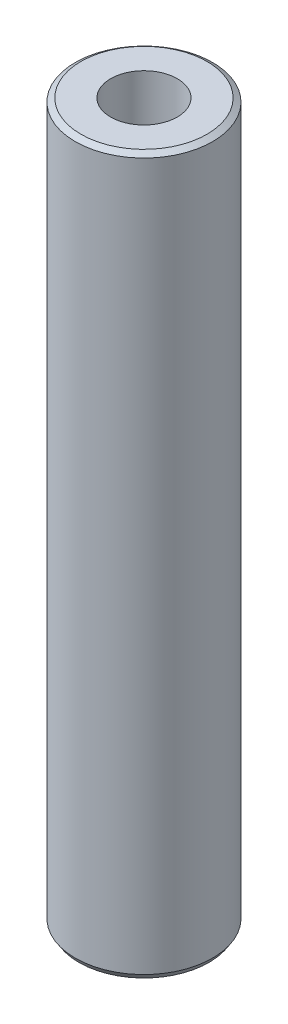
ISO-10303-21;
HEADER;
FILE_DESCRIPTION(('STEP AP214'),'2;1');
FILE_NAME('part.step','',(''),(''),'','','');
FILE_SCHEMA(('AUTOMOTIVE_DESIGN { 1 0 10303 214 1 1 1 1 }'));
ENDSEC;
DATA;
#1=APPLICATION_CONTEXT('core data for automotive mechanical design processes');
#2=APPLICATION_PROTOCOL_DEFINITION('international standard','automotive_design',2000,#1);
#3=PRODUCT_CONTEXT('',#1,'mechanical');
#4=PRODUCT('Part','Part','',(#3));
#5=PRODUCT_RELATED_PRODUCT_CATEGORY('part','',(#4));
#6=PRODUCT_DEFINITION_FORMATION('','',#4);
#7=PRODUCT_DEFINITION_CONTEXT('part definition',#1,'design');
#8=PRODUCT_DEFINITION('design','',#6,#7);
#9=PRODUCT_DEFINITION_SHAPE('','',#8);
#10=(LENGTH_UNIT() NAMED_UNIT(*) SI_UNIT(.MILLI.,.METRE.));
#11=(NAMED_UNIT(*) PLANE_ANGLE_UNIT() SI_UNIT($,.RADIAN.));
#12=(NAMED_UNIT(*) SI_UNIT($,.STERADIAN.) SOLID_ANGLE_UNIT());
#13=UNCERTAINTY_MEASURE_WITH_UNIT(LENGTH_MEASURE(1.E-05),#10,'distance_accuracy_value','');
#14=(GEOMETRIC_REPRESENTATION_CONTEXT(3) GLOBAL_UNCERTAINTY_ASSIGNED_CONTEXT((#13)) GLOBAL_UNIT_ASSIGNED_CONTEXT((#10,
#11,#12)) REPRESENTATION_CONTEXT('',''));
#15=CARTESIAN_POINT('',(0.,0.,0.));
#16=DIRECTION('',(0.,0.,1.));
#17=DIRECTION('',(1.,0.,0.));
#18=AXIS2_PLACEMENT_3D('',#15,#16,#17);
#19=CARTESIAN_POINT('',(0.,600.,0.));
#20=DIRECTION('',(0.,-1.,0.));
#21=DIRECTION('',(0.,0.,-1.));
#22=AXIS2_PLACEMENT_3D('',#19,#20,#21);
#23=CYLINDRICAL_SURFACE('',#22,57.5);
#24=CARTESIAN_POINT('',(0.,596.965997616904,0.));
#25=DIRECTION('',(0.,1.,0.));
#26=DIRECTION('',(0.,0.,1.));
#27=AXIS2_PLACEMENT_3D('',#24,#25,#26);
#28=CIRCLE('',#27,57.5);
#29=CARTESIAN_POINT('',(0.,596.965997616904,57.5));
#30=VERTEX_POINT('',#29);
#31=EDGE_CURVE('E50',#30,#30,#28,.F.);
#32=ORIENTED_EDGE('',*,*,#31,.T.);
#33=EDGE_LOOP('',(#32));
#34=FACE_BOUND('',#33,.T.);
#35=CARTESIAN_POINT('',(0.,4.66833289086133,0.));
#36=DIRECTION('',(0.,1.,0.));
#37=DIRECTION('',(0.,0.,1.));
#38=AXIS2_PLACEMENT_3D('',#35,#36,#37);
#39=CIRCLE('',#38,57.5);
#40=CARTESIAN_POINT('',(0.,4.66833289086133,57.5));
#41=VERTEX_POINT('',#40);
#42=EDGE_CURVE('E51',#41,#41,#39,.T.);
#43=ORIENTED_EDGE('',*,*,#42,.T.);
#44=EDGE_LOOP('',(#43));
#45=FACE_BOUND('',#44,.T.);
#46=ADVANCED_FACE('F39',(#34,#45),#23,.T.);
#47=CARTESIAN_POINT('',(0.,600.,0.));
#48=DIRECTION('',(0.,1.,0.));
#49=DIRECTION('',(0.,0.,1.));
#50=AXIS2_PLACEMENT_3D('',#47,#48,#49);
#51=PLANE('',#50);
#52=CARTESIAN_POINT('',(0.,600.,0.));
#53=DIRECTION('',(0.,1.,0.));
#54=DIRECTION('',(0.,0.,1.));
#55=AXIS2_PLACEMENT_3D('',#52,#53,#54);
#56=CIRCLE('',#55,52.8316671091388);
#57=CARTESIAN_POINT('',(0.,600.,52.8316671091388));
#58=VERTEX_POINT('',#57);
#59=EDGE_CURVE('E54',#58,#58,#56,.T.);
#60=ORIENTED_EDGE('',*,*,#59,.T.);
#61=EDGE_LOOP('',(#60));
#62=FACE_BOUND('',#61,.T.);
#63=CARTESIAN_POINT('',(0.,600.,0.));
#64=DIRECTION('',(0.,1.,0.));
#65=DIRECTION('',(0.,0.,1.));
#66=AXIS2_PLACEMENT_3D('',#63,#64,#65);
#67=CIRCLE('',#66,27.8908906584157);
#68=CARTESIAN_POINT('',(0.,600.,27.8908906584157));
#69=VERTEX_POINT('',#68);
#70=EDGE_CURVE('E58',#69,#69,#67,.T.);
#71=ORIENTED_EDGE('',*,*,#70,.F.);
#72=EDGE_LOOP('',(#71));
#73=FACE_BOUND('',#72,.T.);
#74=ADVANCED_FACE('F69',(#62,#73),#51,.T.);
#75=CARTESIAN_POINT('',(0.,0.,0.));
#76=DIRECTION('',(0.,1.,0.));
#77=DIRECTION('',(0.,0.,1.));
#78=AXIS2_PLACEMENT_3D('',#75,#76,#77);
#79=PLANE('',#78);
#80=CARTESIAN_POINT('',(0.,0.,0.));
#81=DIRECTION('',(0.,1.,0.));
#82=DIRECTION('',(0.,0.,1.));
#83=AXIS2_PLACEMENT_3D('',#80,#81,#82);
#84=CIRCLE('',#83,54.4659976169039);
#85=CARTESIAN_POINT('',(0.,0.,54.4659976169039));
#86=VERTEX_POINT('',#85);
#87=EDGE_CURVE('E10',#86,#86,#84,.F.);
#88=ORIENTED_EDGE('',*,*,#87,.T.);
#89=EDGE_LOOP('',(#88));
#90=FACE_BOUND('',#89,.T.);
#91=CARTESIAN_POINT('',(0.,0.,0.));
#92=DIRECTION('',(0.,1.,0.));
#93=DIRECTION('',(0.,0.,1.));
#94=AXIS2_PLACEMENT_3D('',#91,#92,#93);
#95=CIRCLE('',#94,27.8908906584157);
#96=CARTESIAN_POINT('',(0.,0.,27.8908906584157));
#97=VERTEX_POINT('',#96);
#98=EDGE_CURVE('E63',#97,#97,#95,.T.);
#99=ORIENTED_EDGE('',*,*,#98,.T.);
#100=EDGE_LOOP('',(#99));
#101=FACE_BOUND('',#100,.T.);
#102=ADVANCED_FACE('F75',(#90,#101),#79,.F.);
#103=CARTESIAN_POINT('',(0.,600.,0.));
#104=DIRECTION('',(0.,-1.,0.));
#105=DIRECTION('',(0.,0.,-1.));
#106=AXIS2_PLACEMENT_3D('',#103,#104,#105);
#107=CYLINDRICAL_SURFACE('',#106,27.8908906584157);
#108=ORIENTED_EDGE('',*,*,#70,.T.);
#109=EDGE_LOOP('',(#108));
#110=FACE_BOUND('',#109,.T.);
#111=ORIENTED_EDGE('',*,*,#98,.F.);
#112=EDGE_LOOP('',(#111));
#113=FACE_BOUND('',#112,.T.);
#114=ADVANCED_FACE('F70',(#110,#113),#107,.F.);
#115=CARTESIAN_POINT('',(0.,600.,0.));
#116=DIRECTION('',(0.,-1.,0.));
#117=DIRECTION('',(0.,0.,-1.));
#118=AXIS2_PLACEMENT_3D('',#115,#116,#117);
#119=CONICAL_SURFACE('',#118,52.8316671091388,0.994483450914268);
#120=ORIENTED_EDGE('',*,*,#31,.F.);
#121=EDGE_LOOP('',(#120));
#122=FACE_BOUND('',#121,.T.);
#123=ORIENTED_EDGE('',*,*,#59,.F.);
#124=EDGE_LOOP('',(#123));
#125=FACE_BOUND('',#124,.T.);
#126=ADVANCED_FACE('F81',(#122,#125),#119,.T.);
#127=CARTESIAN_POINT('',(0.,4.66833289086133,0.));
#128=DIRECTION('',(0.,1.,0.));
#129=DIRECTION('',(0.,0.,1.));
#130=AXIS2_PLACEMENT_3D('',#127,#128,#129);
#131=CONICAL_SURFACE('',#130,57.5,0.576312875880611);
#132=ORIENTED_EDGE('',*,*,#87,.F.);
#133=EDGE_LOOP('',(#132));
#134=FACE_BOUND('',#133,.T.);
#135=ORIENTED_EDGE('',*,*,#42,.F.);
#136=EDGE_LOOP('',(#135));
#137=FACE_BOUND('',#136,.T.);
#138=ADVANCED_FACE('F45',(#134,#137),#131,.T.);
#139=CLOSED_SHELL('',(#46,#74,#102,#114,#126,#138));
#140=MANIFOLD_SOLID_BREP('B2',#139);
#141=ADVANCED_BREP_SHAPE_REPRESENTATION('',(#18,#140),#14);
#142=SHAPE_DEFINITION_REPRESENTATION(#9,#141);
ENDSEC;
END-ISO-10303-21;
